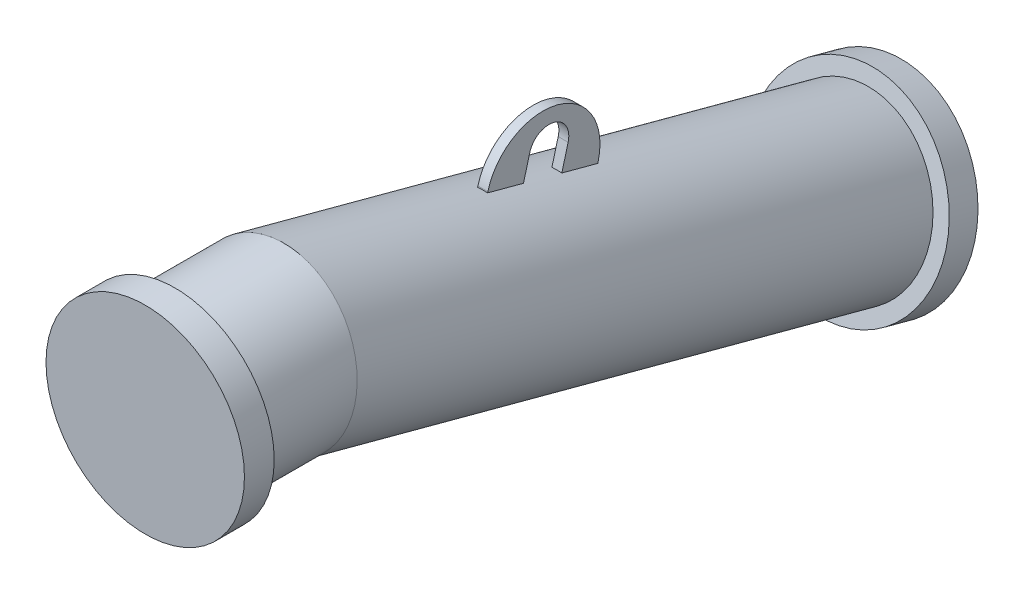
ISO-10303-21;
HEADER;
FILE_DESCRIPTION(('STEP AP214'),'2;1');
FILE_NAME('part.step','',(''),(''),'','','');
FILE_SCHEMA(('AUTOMOTIVE_DESIGN { 1 0 10303 214 1 1 1 1 }'));
ENDSEC;
DATA;
#1=APPLICATION_CONTEXT('core data for automotive mechanical design processes');
#2=APPLICATION_PROTOCOL_DEFINITION('international standard','automotive_design',2000,#1);
#3=PRODUCT_CONTEXT('',#1,'mechanical');
#4=PRODUCT('Part','Part','',(#3));
#5=PRODUCT_RELATED_PRODUCT_CATEGORY('part','',(#4));
#6=PRODUCT_DEFINITION_FORMATION('','',#4);
#7=PRODUCT_DEFINITION_CONTEXT('part definition',#1,'design');
#8=PRODUCT_DEFINITION('design','',#6,#7);
#9=PRODUCT_DEFINITION_SHAPE('','',#8);
#10=(LENGTH_UNIT() NAMED_UNIT(*) SI_UNIT(.MILLI.,.METRE.));
#11=(NAMED_UNIT(*) PLANE_ANGLE_UNIT() SI_UNIT($,.RADIAN.));
#12=(NAMED_UNIT(*) SI_UNIT($,.STERADIAN.) SOLID_ANGLE_UNIT());
#13=UNCERTAINTY_MEASURE_WITH_UNIT(LENGTH_MEASURE(1.E-05),#10,'distance_accuracy_value','');
#14=(GEOMETRIC_REPRESENTATION_CONTEXT(3) GLOBAL_UNCERTAINTY_ASSIGNED_CONTEXT((#13)) GLOBAL_UNIT_ASSIGNED_CONTEXT((#10,
#11,#12)) REPRESENTATION_CONTEXT('',''));
#15=CARTESIAN_POINT('',(0.,0.,0.));
#16=DIRECTION('',(0.,0.,1.));
#17=DIRECTION('',(1.,0.,0.));
#18=AXIS2_PLACEMENT_3D('',#15,#16,#17);
#19=CARTESIAN_POINT('',(0.,-162.729724187535,-736.054971760098));
#20=DIRECTION('',(0.,-0.258819045102521,-0.96592582628907));
#21=DIRECTION('',(1.,0.,0.));
#22=AXIS2_PLACEMENT_3D('',#19,#20,#21);
#23=PLANE('',#22);
#24=CARTESIAN_POINT('',(0.,-162.729724187535,-736.054971760098));
#25=DIRECTION('',(0.,-0.258819045102521,-0.96592582628907));
#26=DIRECTION('',(1.,0.,0.));
#27=AXIS2_PLACEMENT_3D('',#24,#25,#26);
#28=CIRCLE('',#27,100.);
#29=CARTESIAN_POINT('',(100.,-162.729724187535,-736.054971760098));
#30=VERTEX_POINT('',#29);
#31=EDGE_CURVE('E20',#30,#30,#28,.T.);
#32=ORIENTED_EDGE('',*,*,#31,.T.);
#33=EDGE_LOOP('',(#32));
#34=FACE_BOUND('',#33,.T.);
#35=ADVANCED_FACE('F16',(#34),#23,.T.);
#36=CARTESIAN_POINT('',(0.,-154.96515283446,-707.077196971427));
#37=DIRECTION('',(0.,-0.258819045102521,-0.96592582628907));
#38=DIRECTION('',(1.,0.,0.));
#39=AXIS2_PLACEMENT_3D('',#36,#37,#38);
#40=CYLINDRICAL_SURFACE('',#39,100.);
#41=CARTESIAN_POINT('',(0.,-154.96515283446,-707.077196971427));
#42=DIRECTION('',(0.,-0.258819045102521,-0.96592582628907));
#43=DIRECTION('',(1.,0.,0.));
#44=AXIS2_PLACEMENT_3D('',#41,#42,#43);
#45=CIRCLE('',#44,100.);
#46=CARTESIAN_POINT('',(100.,-154.96515283446,-707.077196971427));
#47=VERTEX_POINT('',#46);
#48=EDGE_CURVE('E27',#47,#47,#45,.T.);
#49=ORIENTED_EDGE('',*,*,#48,.T.);
#50=EDGE_LOOP('',(#49));
#51=FACE_BOUND('',#50,.T.);
#52=ORIENTED_EDGE('',*,*,#31,.F.);
#53=EDGE_LOOP('',(#52));
#54=FACE_BOUND('',#53,.T.);
#55=ADVANCED_FACE('F18',(#51,#54),#40,.T.);
#56=CARTESIAN_POINT('',(0.,-154.96515283446,-707.077196971427));
#57=DIRECTION('',(0.,-0.258819045102521,-0.96592582628907));
#58=DIRECTION('',(1.,0.,0.));
#59=AXIS2_PLACEMENT_3D('',#56,#57,#58);
#60=PLANE('',#59);
#61=CARTESIAN_POINT('',(0.,-154.965152834457,-707.077196971416));
#62=DIRECTION('',(0.,0.258819045102514,0.965925826289044));
#63=DIRECTION('',(1.,0.,0.));
#64=AXIS2_PLACEMENT_3D('',#61,#62,#63);
#65=CIRCLE('',#64,84.15);
#66=CARTESIAN_POINT('',(84.15,-154.965152834457,-707.077196971416));
#67=VERTEX_POINT('',#66);
#68=EDGE_CURVE('E10',#67,#67,#65,.T.);
#69=ORIENTED_EDGE('',*,*,#68,.F.);
#70=EDGE_LOOP('',(#69));
#71=FACE_BOUND('',#70,.T.);
#72=ORIENTED_EDGE('',*,*,#48,.F.);
#73=EDGE_LOOP('',(#72));
#74=FACE_BOUND('',#73,.T.);
#75=ADVANCED_FACE('F381',(#71,#74),#60,.F.);
#76=CARTESIAN_POINT('',(5.,39.1303698782753,-401.914653295312));
#77=DIRECTION('',(1.,0.,0.));
#78=DIRECTION('',(0.,0.965925826289068,-0.258819045102522));
#79=AXIS2_PLACEMENT_3D('',#76,#77,#78);
#80=PLANE('',#79);
#81=DIRECTION('',(0.,0.965925826289068,-0.258819045102523));
#82=VECTOR('',#81,1.);
#83=CARTESIAN_POINT('',(5.,21.6539497909867,-337.703480272756));
#84=LINE('',#83,#82);
#85=CARTESIAN_POINT('',(5.,30.3485614942685,-340.033194457152));
#86=VERTEX_POINT('',#85);
#87=CARTESIAN_POINT('',(5.,31.3132080538773,-340.291670723781));
#88=VERTEX_POINT('',#87);
#89=EDGE_CURVE('E315',#86,#88,#84,.T.);
#90=ORIENTED_EDGE('',*,*,#89,.F.);
#91=DIRECTION('',(0.,-0.258819045102514,-0.965925826289044));
#92=VECTOR('',#91,1.);
#93=CARTESIAN_POINT('',(5.00000000000001,-48.2704738762996,-633.44342890216));
#94=LINE('',#93,#92);
#95=CARTESIAN_POINT('',(5.00000000000001,20.6428473029207,-376.255412942997));
#96=VERTEX_POINT('',#95);
#97=EDGE_CURVE('E52',#86,#96,#94,.T.);
#98=ORIENTED_EDGE('',*,*,#97,.T.);
#99=DIRECTION('',(0.,0.965925826289069,-0.258819045102523));
#100=VECTOR('',#99,1.);
#101=CARTESIAN_POINT('',(5.00000000000001,21.6074938625331,-376.51388920962));
#102=LINE('',#101,#100);
#103=CARTESIAN_POINT('',(5.00000000000004,44.3067507803258,-382.596136769529));
#104=VERTEX_POINT('',#103);
#105=EDGE_CURVE('E322',#96,#104,#102,.T.);
#106=ORIENTED_EDGE('',*,*,#105,.T.);
#107=CARTESIAN_POINT('',(5.,39.1303698782753,-401.914653295312));
#108=DIRECTION('',(-1.,0.,0.));
#109=DIRECTION('',(0.,0.965925826289068,-0.258819045102522));
#110=AXIS2_PLACEMENT_3D('',#107,#108,#109);
#111=CIRCLE('',#110,20.);
#112=CARTESIAN_POINT('',(5.00000000000001,33.9539889762252,-421.233169821094));
#113=VERTEX_POINT('',#112);
#114=EDGE_CURVE('E325',#104,#113,#111,.T.);
#115=ORIENTED_EDGE('',*,*,#114,.T.);
#116=DIRECTION('',(0.,-0.965925826289068,0.258819045102522));
#117=VECTOR('',#116,1.);
#118=CARTESIAN_POINT('',(5.00000000000001,11.2547320584321,-415.150922261183));
#119=LINE('',#118,#117);
#120=CARTESIAN_POINT('',(5.00000000000001,10.2900854988201,-414.892445994559));
#121=VERTEX_POINT('',#120);
#122=EDGE_CURVE('E329',#113,#121,#119,.T.);
#123=ORIENTED_EDGE('',*,*,#122,.T.);
#124=CARTESIAN_POINT('',(5.00000000000001,0.584371307478751,-451.114664480395));
#125=VERTEX_POINT('',#124);
#126=EDGE_CURVE('E294',#121,#125,#94,.T.);
#127=ORIENTED_EDGE('',*,*,#126,.T.);
#128=DIRECTION('',(0.,0.965925826289068,-0.258819045102523));
#129=VECTOR('',#128,1.);
#130=CARTESIAN_POINT('',(5.00000000000001,-8.11024039580332,-448.784950295998));
#131=LINE('',#130,#129);
#132=CARTESIAN_POINT('',(5.00000000000001,1.54901786708727,-451.373140747023));
#133=VERTEX_POINT('',#132);
#134=EDGE_CURVE('E309',#125,#133,#131,.T.);
#135=ORIENTED_EDGE('',*,*,#134,.T.);
#136=CARTESIAN_POINT('',(5.00000000000002,16.4311129604825,-395.832405735402));
#137=DIRECTION('',(1.,0.,0.));
#138=DIRECTION('',(0.,0.965925826289068,-0.258819045102522));
#139=AXIS2_PLACEMENT_3D('',#136,#137,#138);
#140=CIRCLE('',#139,57.5);
#141=EDGE_CURVE('E332',#133,#88,#140,.T.);
#142=ORIENTED_EDGE('',*,*,#141,.T.);
#143=EDGE_LOOP('',(#90,#98,#106,#115,#123,#127,#135,#142));
#144=FACE_BOUND('',#143,.T.);
#145=ADVANCED_FACE('F387',(#144),#80,.T.);
#146=CARTESIAN_POINT('',(-5.00000000000002,39.1303698782756,-401.914653295311));
#147=DIRECTION('',(1.,0.,0.));
#148=DIRECTION('',(0.,0.965925826289068,-0.258819045102522));
#149=AXIS2_PLACEMENT_3D('',#146,#147,#148);
#150=PLANE('',#149);
#151=DIRECTION('',(0.,-0.258819045102514,-0.965925826289044));
#152=VECTOR('',#151,1.);
#153=CARTESIAN_POINT('',(-5.00000000000006,-48.2704738762996,-633.44342890216));
#154=LINE('',#153,#152);
#155=CARTESIAN_POINT('',(-5.00000000000002,30.3485614942687,-340.033194457152));
#156=VERTEX_POINT('',#155);
#157=CARTESIAN_POINT('',(-5.00000000000004,20.6428473029207,-376.255412942997));
#158=VERTEX_POINT('',#157);
#159=EDGE_CURVE('E295',#156,#158,#154,.T.);
#160=ORIENTED_EDGE('',*,*,#159,.F.);
#161=DIRECTION('',(0.,0.965925826289068,-0.258819045102523));
#162=VECTOR('',#161,1.);
#163=CARTESIAN_POINT('',(-5.00000000000002,21.6539497909869,-337.703480272755));
#164=LINE('',#163,#162);
#165=CARTESIAN_POINT('',(-5.00000000000002,31.3132080538773,-340.29167072378));
#166=VERTEX_POINT('',#165);
#167=EDGE_CURVE('E318',#156,#166,#164,.T.);
#168=ORIENTED_EDGE('',*,*,#167,.T.);
#169=CARTESIAN_POINT('',(-5.00000000000001,16.4311129604826,-395.832405735402));
#170=DIRECTION('',(1.,0.,0.));
#171=DIRECTION('',(0.,0.965925826289068,-0.258819045102522));
#172=AXIS2_PLACEMENT_3D('',#169,#170,#171);
#173=CIRCLE('',#172,57.5);
#174=CARTESIAN_POINT('',(-5.00000000000001,1.54901786708719,-451.373140747024));
#175=VERTEX_POINT('',#174);
#176=EDGE_CURVE('E326',#175,#166,#173,.T.);
#177=ORIENTED_EDGE('',*,*,#176,.F.);
#178=DIRECTION('',(0.,0.965925826289068,-0.258819045102523));
#179=VECTOR('',#178,1.);
#180=CARTESIAN_POINT('',(-5.00000000000001,-8.11024039580349,-448.784950295999));
#181=LINE('',#180,#179);
#182=CARTESIAN_POINT('',(-5.00000000000001,0.584371307478584,-451.114664480396));
#183=VERTEX_POINT('',#182);
#184=EDGE_CURVE('E312',#183,#175,#181,.T.);
#185=ORIENTED_EDGE('',*,*,#184,.F.);
#186=CARTESIAN_POINT('',(-5.00000000000004,10.29008549882,-414.892445994559));
#187=VERTEX_POINT('',#186);
#188=EDGE_CURVE('E279',#187,#183,#154,.T.);
#189=ORIENTED_EDGE('',*,*,#188,.F.);
#190=DIRECTION('',(0.,-0.965925826289068,0.258819045102522));
#191=VECTOR('',#190,1.);
#192=CARTESIAN_POINT('',(-5.00000000000001,11.2547320584321,-415.150922261183));
#193=LINE('',#192,#191);
#194=CARTESIAN_POINT('',(-5.00000000000002,33.9539889762252,-421.233169821094));
#195=VERTEX_POINT('',#194);
#196=EDGE_CURVE('E342',#195,#187,#193,.T.);
#197=ORIENTED_EDGE('',*,*,#196,.F.);
#198=CARTESIAN_POINT('',(-5.00000000000002,39.1303698782756,-401.914653295311));
#199=DIRECTION('',(-1.,0.,0.));
#200=DIRECTION('',(0.,0.965925826289068,-0.258819045102522));
#201=AXIS2_PLACEMENT_3D('',#198,#199,#200);
#202=CIRCLE('',#201,20.);
#203=CARTESIAN_POINT('',(-4.99999999999999,44.3067507803258,-382.596136769529));
#204=VERTEX_POINT('',#203);
#205=EDGE_CURVE('E339',#204,#195,#202,.T.);
#206=ORIENTED_EDGE('',*,*,#205,.F.);
#207=DIRECTION('',(0.,0.965925826289069,-0.258819045102523));
#208=VECTOR('',#207,1.);
#209=CARTESIAN_POINT('',(-5.00000000000001,21.6074938625331,-376.51388920962));
#210=LINE('',#209,#208);
#211=EDGE_CURVE('E321',#158,#204,#210,.T.);
#212=ORIENTED_EDGE('',*,*,#211,.F.);
#213=EDGE_LOOP('',(#160,#168,#177,#185,#189,#197,#206,#212));
#214=FACE_BOUND('',#213,.T.);
#215=ADVANCED_FACE('F397',(#214),#150,.F.);
#216=CARTESIAN_POINT('',(5.00000000000001,21.6074938625331,-376.51388920962));
#217=DIRECTION('',(0.,0.258819045102521,0.965925826289069));
#218=DIRECTION('',(0.,-0.965925826289069,0.258819045102523));
#219=AXIS2_PLACEMENT_3D('',#216,#217,#218);
#220=PLANE('',#219);
#221=CARTESIAN_POINT('',(0.,-60.4962013720365,-354.514270375906));
#222=DIRECTION('',(0.,0.258819045102521,0.965925826289069));
#223=DIRECTION('',(0.,-0.965925826289068,0.258819045102521));
#224=AXIS2_PLACEMENT_3D('',#221,#222,#223);
#225=CIRCLE('',#224,84.15);
#226=EDGE_CURVE('E305',#158,#96,#225,.F.);
#227=ORIENTED_EDGE('',*,*,#226,.F.);
#228=ORIENTED_EDGE('',*,*,#211,.T.);
#229=DIRECTION('',(-1.,0.,0.));
#230=VECTOR('',#229,1.);
#231=CARTESIAN_POINT('',(5.00000000000004,44.3067507803258,-382.596136769529));
#232=LINE('',#231,#230);
#233=EDGE_CURVE('E359',#104,#204,#232,.T.);
#234=ORIENTED_EDGE('',*,*,#233,.F.);
#235=ORIENTED_EDGE('',*,*,#105,.F.);
#236=EDGE_LOOP('',(#227,#228,#234,#235));
#237=FACE_BOUND('',#236,.T.);
#238=ADVANCED_FACE('F393',(#237),#220,.F.);
#239=CARTESIAN_POINT('',(5.,39.1303698782753,-401.914653295312));
#240=DIRECTION('',(-1.,0.,0.));
#241=DIRECTION('',(0.,-0.965925826289068,0.258819045102522));
#242=AXIS2_PLACEMENT_3D('',#239,#240,#241);
#243=CYLINDRICAL_SURFACE('',#242,20.);
#244=ORIENTED_EDGE('',*,*,#205,.T.);
#245=DIRECTION('',(-1.,0.,0.));
#246=VECTOR('',#245,1.);
#247=CARTESIAN_POINT('',(5.00000000000001,33.9539889762252,-421.233169821094));
#248=LINE('',#247,#246);
#249=EDGE_CURVE('E355',#113,#195,#248,.T.);
#250=ORIENTED_EDGE('',*,*,#249,.F.);
#251=ORIENTED_EDGE('',*,*,#114,.F.);
#252=ORIENTED_EDGE('',*,*,#233,.T.);
#253=EDGE_LOOP('',(#244,#250,#251,#252));
#254=FACE_BOUND('',#253,.T.);
#255=ADVANCED_FACE('F396',(#254),#243,.F.);
#256=CARTESIAN_POINT('',(5.00000000000001,11.2547320584321,-415.150922261183));
#257=DIRECTION('',(0.,-0.258819045102521,-0.96592582628907));
#258=DIRECTION('',(0.,0.965925826289068,-0.258819045102522));
#259=AXIS2_PLACEMENT_3D('',#256,#257,#258);
#260=PLANE('',#259);
#261=CARTESIAN_POINT('',(0.,-70.8489631761375,-393.151303427469));
#262=DIRECTION('',(0.,-0.258819045102521,-0.96592582628907));
#263=DIRECTION('',(0.,0.965925826289069,-0.25881904510252));
#264=AXIS2_PLACEMENT_3D('',#261,#262,#263);
#265=CIRCLE('',#264,84.15);
#266=EDGE_CURVE('E40',#121,#187,#265,.F.);
#267=ORIENTED_EDGE('',*,*,#266,.F.);
#268=ORIENTED_EDGE('',*,*,#122,.F.);
#269=ORIENTED_EDGE('',*,*,#249,.T.);
#270=ORIENTED_EDGE('',*,*,#196,.T.);
#271=EDGE_LOOP('',(#267,#268,#269,#270));
#272=FACE_BOUND('',#271,.T.);
#273=ADVANCED_FACE('F401',(#272),#260,.F.);
#274=CARTESIAN_POINT('',(5.00000000000002,16.4311129604825,-395.832405735402));
#275=DIRECTION('',(-1.,0.,0.));
#276=DIRECTION('',(0.,-0.965925826289068,0.258819045102522));
#277=AXIS2_PLACEMENT_3D('',#274,#275,#276);
#278=CYLINDRICAL_SURFACE('',#277,57.5);
#279=ORIENTED_EDGE('',*,*,#176,.T.);
#280=DIRECTION('',(-1.,0.,0.));
#281=VECTOR('',#280,1.);
#282=CARTESIAN_POINT('',(5.,31.3132080538773,-340.291670723781));
#283=LINE('',#282,#281);
#284=EDGE_CURVE('E336',#88,#166,#283,.T.);
#285=ORIENTED_EDGE('',*,*,#284,.F.);
#286=ORIENTED_EDGE('',*,*,#141,.F.);
#287=DIRECTION('',(-1.,0.,0.));
#288=VECTOR('',#287,1.);
#289=CARTESIAN_POINT('',(5.00000000000001,1.54901786708727,-451.373140747023));
#290=LINE('',#289,#288);
#291=EDGE_CURVE('E351',#133,#175,#290,.T.);
#292=ORIENTED_EDGE('',*,*,#291,.T.);
#293=EDGE_LOOP('',(#279,#285,#286,#292));
#294=FACE_BOUND('',#293,.T.);
#295=ADVANCED_FACE('F405',(#294),#278,.T.);
#296=CARTESIAN_POINT('',(5.,21.6539497909867,-337.703480272756));
#297=DIRECTION('',(0.,-0.258819045102523,-0.965925826289068));
#298=DIRECTION('',(0.,0.965925826289068,-0.258819045102523));
#299=AXIS2_PLACEMENT_3D('',#296,#297,#298);
#300=PLANE('',#299);
#301=CARTESIAN_POINT('',(0.,-50.7904871806922,-318.292051890067));
#302=DIRECTION('',(0.,-0.258819045102523,-0.965925826289068));
#303=DIRECTION('',(0.,0.965925826289068,-0.258819045102523));
#304=AXIS2_PLACEMENT_3D('',#301,#302,#303);
#305=CIRCLE('',#304,84.15);
#306=EDGE_CURVE('E301',#86,#156,#305,.F.);
#307=ORIENTED_EDGE('',*,*,#306,.F.);
#308=ORIENTED_EDGE('',*,*,#89,.T.);
#309=ORIENTED_EDGE('',*,*,#284,.T.);
#310=ORIENTED_EDGE('',*,*,#167,.F.);
#311=EDGE_LOOP('',(#307,#308,#309,#310));
#312=FACE_BOUND('',#311,.T.);
#313=ADVANCED_FACE('F408',(#312),#300,.F.);
#314=CARTESIAN_POINT('',(-5.00000000000001,-8.11024039580349,-448.784950295999));
#315=DIRECTION('',(0.,0.258819045102523,0.965925826289068));
#316=DIRECTION('',(0.,-0.965925826289068,0.258819045102523));
#317=AXIS2_PLACEMENT_3D('',#314,#315,#316);
#318=PLANE('',#317);
#319=CARTESIAN_POINT('',(0.,-80.5546773674822,-429.37352191331));
#320=DIRECTION('',(0.,0.258819045102523,0.965925826289068));
#321=DIRECTION('',(0.,-0.965925826289068,0.258819045102523));
#322=AXIS2_PLACEMENT_3D('',#319,#320,#321);
#323=CIRCLE('',#322,84.15);
#324=EDGE_CURVE('E363',#183,#125,#323,.F.);
#325=ORIENTED_EDGE('',*,*,#324,.F.);
#326=ORIENTED_EDGE('',*,*,#184,.T.);
#327=ORIENTED_EDGE('',*,*,#291,.F.);
#328=ORIENTED_EDGE('',*,*,#134,.F.);
#329=EDGE_LOOP('',(#325,#326,#327,#328));
#330=FACE_BOUND('',#329,.T.);
#331=ADVANCED_FACE('F417',(#330),#318,.F.);
#332=CARTESIAN_POINT('',(0.,-129.409522551259,-611.702286335075));
#333=DIRECTION('',(0.,-0.258819045102514,-0.965925826289044));
#334=DIRECTION('',(-1.,0.,0.));
#335=AXIS2_PLACEMENT_3D('',#332,#333,#334);
#336=CYLINDRICAL_SURFACE('',#335,84.15);
#337=ORIENTED_EDGE('',*,*,#68,.T.);
#338=EDGE_LOOP('',(#337));
#339=FACE_BOUND('',#338,.T.);
#340=CARTESIAN_POINT('',(0.,0.,-128.739373190547));
#341=DIRECTION('',(0.,-0.130526192220052,-0.991444861373812));
#342=DIRECTION('',(0.,-0.991444861373812,0.130526192220052));
#343=AXIS2_PLACEMENT_3D('',#340,#341,#342);
#344=ELLIPSE('',#343,84.8761270328199,84.15);
#345=CARTESIAN_POINT('',(0.,-84.1500000000001,-117.660815518567));
#346=VERTEX_POINT('',#345);
#347=EDGE_CURVE('E271',#346,#346,#344,.T.);
#348=ORIENTED_EDGE('',*,*,#347,.T.);
#349=EDGE_LOOP('',(#348));
#350=FACE_BOUND('',#349,.T.);
#351=ORIENTED_EDGE('',*,*,#126,.F.);
#352=ORIENTED_EDGE('',*,*,#266,.T.);
#353=ORIENTED_EDGE('',*,*,#188,.T.);
#354=ORIENTED_EDGE('',*,*,#324,.T.);
#355=EDGE_LOOP('',(#351,#352,#353,#354));
#356=FACE_BOUND('',#355,.T.);
#357=ORIENTED_EDGE('',*,*,#159,.T.);
#358=ORIENTED_EDGE('',*,*,#226,.T.);
#359=ORIENTED_EDGE('',*,*,#97,.F.);
#360=ORIENTED_EDGE('',*,*,#306,.T.);
#361=EDGE_LOOP('',(#357,#358,#359,#360));
#362=FACE_BOUND('',#361,.T.);
#363=ADVANCED_FACE('F421',(#339,#350,#356,#362),#336,.T.);
#364=CARTESIAN_POINT('',(0.,-3.60822483003176E-13,-29.9999999999989));
#365=DIRECTION('',(0.,0.,1.));
#366=DIRECTION('',(1.,0.,0.));
#367=AXIS2_PLACEMENT_3D('',#364,#365,#366);
#368=CYLINDRICAL_SURFACE('',#367,100.);
#369=CARTESIAN_POINT('',(0.,-3.60822483003176E-13,-29.9999999999989));
#370=DIRECTION('',(0.,0.,1.));
#371=DIRECTION('',(1.,0.,0.));
#372=AXIS2_PLACEMENT_3D('',#369,#370,#371);
#373=CIRCLE('',#372,100.);
#374=CARTESIAN_POINT('',(100.,-3.86571475861723E-13,-29.9999999999989));
#375=VERTEX_POINT('',#374);
#376=EDGE_CURVE('E280',#375,#375,#373,.T.);
#377=ORIENTED_EDGE('',*,*,#376,.T.);
#378=EDGE_LOOP('',(#377));
#379=FACE_BOUND('',#378,.T.);
#380=CARTESIAN_POINT('',(0.,0.,0.));
#381=DIRECTION('',(0.,0.,1.));
#382=DIRECTION('',(1.,0.,0.));
#383=AXIS2_PLACEMENT_3D('',#380,#381,#382);
#384=CIRCLE('',#383,100.);
#385=CARTESIAN_POINT('',(100.,0.,0.));
#386=VERTEX_POINT('',#385);
#387=EDGE_CURVE('E284',#386,#386,#384,.T.);
#388=ORIENTED_EDGE('',*,*,#387,.F.);
#389=EDGE_LOOP('',(#388));
#390=FACE_BOUND('',#389,.T.);
#391=ADVANCED_FACE('F423',(#379,#390),#368,.T.);
#392=CARTESIAN_POINT('',(0.,-3.60822483003176E-13,-29.9999999999989));
#393=DIRECTION('',(0.,0.,1.));
#394=DIRECTION('',(1.,0.,0.));
#395=AXIS2_PLACEMENT_3D('',#392,#393,#394);
#396=PLANE('',#395);
#397=CARTESIAN_POINT('',(0.,0.,-30.));
#398=DIRECTION('',(0.,0.,-1.));
#399=DIRECTION('',(-1.,0.,0.));
#400=AXIS2_PLACEMENT_3D('',#397,#398,#399);
#401=CIRCLE('',#400,84.15);
#402=CARTESIAN_POINT('',(-84.1500000000002,0.,-30.));
#403=VERTEX_POINT('',#402);
#404=EDGE_CURVE('E275',#403,#403,#401,.T.);
#405=ORIENTED_EDGE('',*,*,#404,.F.);
#406=EDGE_LOOP('',(#405));
#407=FACE_BOUND('',#406,.T.);
#408=ORIENTED_EDGE('',*,*,#376,.F.);
#409=EDGE_LOOP('',(#408));
#410=FACE_BOUND('',#409,.T.);
#411=ADVANCED_FACE('F426',(#407,#410),#396,.F.);
#412=CARTESIAN_POINT('',(0.,0.,-128.739373190547));
#413=DIRECTION('',(0.,0.,1.));
#414=DIRECTION('',(1.,0.,0.));
#415=AXIS2_PLACEMENT_3D('',#412,#413,#414);
#416=CYLINDRICAL_SURFACE('',#415,84.15);
#417=ORIENTED_EDGE('',*,*,#404,.T.);
#418=EDGE_LOOP('',(#417));
#419=FACE_BOUND('',#418,.T.);
#420=ORIENTED_EDGE('',*,*,#347,.F.);
#421=EDGE_LOOP('',(#420));
#422=FACE_BOUND('',#421,.T.);
#423=ADVANCED_FACE('F431',(#419,#422),#416,.T.);
#424=CARTESIAN_POINT('',(0.,0.,0.));
#425=DIRECTION('',(0.,0.,1.));
#426=DIRECTION('',(1.,0.,0.));
#427=AXIS2_PLACEMENT_3D('',#424,#425,#426);
#428=PLANE('',#427);
#429=ORIENTED_EDGE('',*,*,#387,.T.);
#430=EDGE_LOOP('',(#429));
#431=FACE_BOUND('',#430,.T.);
#432=ADVANCED_FACE('F428',(#431),#428,.T.);
#433=CLOSED_SHELL('',(#35,#55,#75,#145,#215,#238,#255,#273,#295,#313,#331,#363,#391,#411,#423,#432));
#434=CARTESIAN_POINT('',(0.,-3.60822483003176E-13,-29.9999999999989));
#435=DIRECTION('',(0.,0.,1.));
#436=DIRECTION('',(1.,0.,0.));
#437=AXIS2_PLACEMENT_3D('',#434,#435,#436);
#438=PLANE('',#437);
#439=CARTESIAN_POINT('',(0.,-3.60822483003176E-13,-29.9999999999989));
#440=DIRECTION('',(0.,0.,1.));
#441=DIRECTION('',(1.,0.,0.));
#442=AXIS2_PLACEMENT_3D('',#439,#440,#441);
#443=CIRCLE('',#442,39.5);
#444=CARTESIAN_POINT('',(39.5,-3.70993335182302E-13,-29.9999999999989));
#445=VERTEX_POINT('',#444);
#446=EDGE_CURVE('E208',#445,#445,#443,.T.);
#447=ORIENTED_EDGE('',*,*,#446,.T.);
#448=EDGE_LOOP('',(#447));
#449=FACE_BOUND('',#448,.T.);
#450=CARTESIAN_POINT('',(0.,0.,-30.));
#451=DIRECTION('',(0.,0.,-1.));
#452=DIRECTION('',(0.,1.,0.));
#453=AXIS2_PLACEMENT_3D('',#450,#451,#452);
#454=CIRCLE('',#453,40.);
#455=CARTESIAN_POINT('',(0.,40.,-30.));
#456=VERTEX_POINT('',#455);
#457=EDGE_CURVE('E266',#456,#456,#454,.T.);
#458=ORIENTED_EDGE('',*,*,#457,.T.);
#459=EDGE_LOOP('',(#458));
#460=FACE_BOUND('',#459,.T.);
#461=ADVANCED_FACE('F446',(#449,#460),#438,.F.);
#462=CARTESIAN_POINT('',(0.,-750.,-30.));
#463=DIRECTION('',(-1.,0.,0.));
#464=DIRECTION('',(0.,0.,1.));
#465=AXIS2_PLACEMENT_3D('',#462,#463,#464);
#466=TOROIDAL_SURFACE('',#465,750.,40.);
#467=CARTESIAN_POINT('',(0.,-25.5556302831988,-224.114283826891));
#468=DIRECTION('',(0.,0.258819045102523,0.96592582628907));
#469=DIRECTION('',(1.,0.,0.));
#470=AXIS2_PLACEMENT_3D('',#467,#468,#469);
#471=CIRCLE('',#470,40.);
#472=CARTESIAN_POINT('',(0.,13.081402768364,-234.467045630991));
#473=VERTEX_POINT('',#472);
#474=EDGE_CURVE('E262',#473,#473,#471,.T.);
#475=CARTESIAN_POINT('',(0.,-750.,-30.));
#476=DIRECTION('',(-1.,0.,0.));
#477=DIRECTION('',(0.,0.,1.));
#478=AXIS2_PLACEMENT_3D('',#475,#476,#477);
#479=CIRCLE('',#478,790.);
#480=EDGE_CURVE('',#456,#473,#479,.T.);
#481=ORIENTED_EDGE('',*,*,#457,.F.);
#482=ORIENTED_EDGE('',*,*,#474,.F.);
#483=ORIENTED_EDGE('',*,*,#480,.T.);
#484=ORIENTED_EDGE('',*,*,#480,.F.);
#485=EDGE_LOOP('',(#481,#483,#482,#484));
#486=FACE_BOUND('',#485,.T.);
#487=ADVANCED_FACE('F442',(#486),#466,.F.);
#488=CARTESIAN_POINT('',(0.,-25.5556302831988,-224.114283826891));
#489=DIRECTION('',(0.,-0.258819045102523,-0.96592582628907));
#490=DIRECTION('',(-1.,0.,0.));
#491=AXIS2_PLACEMENT_3D('',#488,#489,#490);
#492=CYLINDRICAL_SURFACE('',#491,40.);
#493=ORIENTED_EDGE('',*,*,#474,.T.);
#494=EDGE_LOOP('',(#493));
#495=FACE_BOUND('',#494,.T.);
#496=CARTESIAN_POINT('',(0.,-154.96515283446,-707.077196971426));
#497=DIRECTION('',(0.,0.258819045102523,0.96592582628907));
#498=DIRECTION('',(1.,0.,0.));
#499=AXIS2_PLACEMENT_3D('',#496,#497,#498);
#500=CIRCLE('',#499,40.);
#501=CARTESIAN_POINT('',(40.,-154.96515283446,-707.077196971426));
#502=VERTEX_POINT('',#501);
#503=EDGE_CURVE('E267',#502,#502,#500,.T.);
#504=ORIENTED_EDGE('',*,*,#503,.F.);
#505=EDGE_LOOP('',(#504));
#506=FACE_BOUND('',#505,.T.);
#507=ADVANCED_FACE('F445',(#495,#506),#492,.F.);
#508=CARTESIAN_POINT('',(0.,-154.96515283446,-707.077196971427));
#509=DIRECTION('',(0.,-0.258819045102521,-0.96592582628907));
#510=DIRECTION('',(1.,0.,0.));
#511=AXIS2_PLACEMENT_3D('',#508,#509,#510);
#512=PLANE('',#511);
#513=CARTESIAN_POINT('',(0.,-154.96515283446,-707.077196971427));
#514=DIRECTION('',(0.,-0.258819045102521,-0.96592582628907));
#515=DIRECTION('',(1.,0.,0.));
#516=AXIS2_PLACEMENT_3D('',#513,#514,#515);
#517=CIRCLE('',#516,39.5);
#518=CARTESIAN_POINT('',(39.5,-154.96515283446,-707.077196971427));
#519=VERTEX_POINT('',#518);
#520=EDGE_CURVE('E648',#519,#519,#517,.T.);
#521=ORIENTED_EDGE('',*,*,#520,.T.);
#522=EDGE_LOOP('',(#521));
#523=FACE_BOUND('',#522,.T.);
#524=ORIENTED_EDGE('',*,*,#503,.T.);
#525=EDGE_LOOP('',(#524));
#526=FACE_BOUND('',#525,.T.);
#527=ADVANCED_FACE('F451',(#523,#526),#512,.F.);
#528=CARTESIAN_POINT('',(0.,-154.96515283446,-707.077196971427));
#529=DIRECTION('',(0.,-0.258819045102521,-0.96592582628907));
#530=DIRECTION('',(1.,0.,0.));
#531=AXIS2_PLACEMENT_3D('',#528,#529,#530);
#532=CYLINDRICAL_SURFACE('',#531,39.5);
#533=ORIENTED_EDGE('',*,*,#520,.F.);
#534=EDGE_LOOP('',(#533));
#535=FACE_BOUND('',#534,.T.);
#536=CARTESIAN_POINT('',(0.,-156.259248059972,-711.906826102872));
#537=DIRECTION('',(0.,-0.258819045102521,-0.965925826289068));
#538=DIRECTION('',(0.,0.965925826289068,-0.258819045102521));
#539=AXIS2_PLACEMENT_3D('',#536,#537,#538);
#540=CIRCLE('',#539,39.5);
#541=CARTESIAN_POINT('',(0.,-118.105177921554,-722.130178384421));
#542=VERTEX_POINT('',#541);
#543=EDGE_CURVE('E201',#542,#542,#540,.F.);
#544=ORIENTED_EDGE('',*,*,#543,.F.);
#545=EDGE_LOOP('',(#544));
#546=FACE_BOUND('',#545,.T.);
#547=ADVANCED_FACE('F455',(#535,#546),#532,.F.);
#548=CARTESIAN_POINT('',(0.,-156.259248059972,-711.906826102872));
#549=DIRECTION('',(0.,-0.258819045102521,-0.965925826289068));
#550=DIRECTION('',(0.,0.965925826289068,-0.258819045102521));
#551=AXIS2_PLACEMENT_3D('',#548,#549,#550);
#552=PLANE('',#551);
#553=ORIENTED_EDGE('',*,*,#543,.T.);
#554=EDGE_LOOP('',(#553));
#555=FACE_BOUND('',#554,.T.);
#556=ADVANCED_FACE('F594',(#555),#552,.F.);
#557=CARTESIAN_POINT('',(0.,0.,-25.));
#558=DIRECTION('',(0.,0.,1.));
#559=DIRECTION('',(1.,0.,0.));
#560=AXIS2_PLACEMENT_3D('',#557,#558,#559);
#561=PLANE('',#560);
#562=CARTESIAN_POINT('',(0.,-3.60822483003176E-13,-25.));
#563=DIRECTION('',(0.,0.,1.));
#564=DIRECTION('',(1.,0.,0.));
#565=AXIS2_PLACEMENT_3D('',#562,#563,#564);
#566=CIRCLE('',#565,39.5);
#567=CARTESIAN_POINT('',(39.5,-3.60822483003176E-13,-25.));
#568=VERTEX_POINT('',#567);
#569=EDGE_CURVE('E207',#568,#568,#566,.F.);
#570=ORIENTED_EDGE('',*,*,#569,.T.);
#571=EDGE_LOOP('',(#570));
#572=FACE_BOUND('',#571,.T.);
#573=ADVANCED_FACE('F590',(#572),#561,.F.);
#574=CARTESIAN_POINT('',(0.,-3.60822483003176E-13,-29.9999999999989));
#575=DIRECTION('',(0.,0.,1.));
#576=DIRECTION('',(1.,0.,0.));
#577=AXIS2_PLACEMENT_3D('',#574,#575,#576);
#578=CYLINDRICAL_SURFACE('',#577,39.5);
#579=ORIENTED_EDGE('',*,*,#446,.F.);
#580=EDGE_LOOP('',(#579));
#581=FACE_BOUND('',#580,.T.);
#582=ORIENTED_EDGE('',*,*,#569,.F.);
#583=EDGE_LOOP('',(#582));
#584=FACE_BOUND('',#583,.T.);
#585=ADVANCED_FACE('F593',(#581,#584),#578,.F.);
#586=CLOSED_SHELL('',(#461,#487,#507,#527,#547,#556,#573,#585));
#587=CARTESIAN_POINT('',(-30.614674589207,-73.9103626009032,-23.9999999999986));
#588=DIRECTION('',(0.,0.,1.));
#589=DIRECTION('',(0.,-1.,0.));
#590=AXIS2_PLACEMENT_3D('',#587,#588,#589);
#591=PLANE('',#590);
#592=CARTESIAN_POINT('',(-30.614674589207,-73.9103626009032,-23.9999999999986));
#593=DIRECTION('',(0.,0.,1.));
#594=DIRECTION('',(1.,0.,0.));
#595=AXIS2_PLACEMENT_3D('',#592,#593,#594);
#596=CIRCLE('',#595,6.99999999999999);
#597=CARTESIAN_POINT('',(-23.614674589207,-73.9103626009032,-23.9999999999986));
#598=VERTEX_POINT('',#597);
#599=EDGE_CURVE('E215',#598,#598,#596,.T.);
#600=ORIENTED_EDGE('',*,*,#599,.F.);
#601=EDGE_LOOP('',(#600));
#602=FACE_BOUND('',#601,.T.);
#603=ADVANCED_FACE('F580',(#602),#591,.F.);
#604=CARTESIAN_POINT('',(-30.614674589207,-73.9103626009032,-23.9999999999986));
#605=DIRECTION('',(0.,0.,1.));
#606=DIRECTION('',(1.,0.,0.));
#607=AXIS2_PLACEMENT_3D('',#604,#605,#606);
#608=CONICAL_SURFACE('',#607,6.99999999999999,1.02974425867665);
#609=CARTESIAN_POINT('',(-30.614674589207,-73.9103626009034,-28.2060243331915));
#610=VERTEX_POINT('',#609);
#611=VERTEX_LOOP('',#610);
#612=FACE_BOUND('',#611,.T.);
#613=ORIENTED_EDGE('',*,*,#599,.T.);
#614=EDGE_LOOP('',(#613));
#615=FACE_BOUND('',#614,.T.);
#616=ADVANCED_FACE('F583',(#612,#615),#608,.F.);
#617=CLOSED_SHELL('',(#603,#616));
#618=CARTESIAN_POINT('',(30.6146745892075,-73.9103626009032,-23.9999999999986));
#619=DIRECTION('',(0.,0.,1.));
#620=DIRECTION('',(0.,-1.,0.));
#621=AXIS2_PLACEMENT_3D('',#618,#619,#620);
#622=PLANE('',#621);
#623=CARTESIAN_POINT('',(30.6146745892075,-73.9103626009032,-23.9999999999986));
#624=DIRECTION('',(0.,0.,1.));
#625=DIRECTION('',(1.,0.,0.));
#626=AXIS2_PLACEMENT_3D('',#623,#624,#625);
#627=CIRCLE('',#626,6.99999999999999);
#628=CARTESIAN_POINT('',(37.6146745892075,-73.9103626009032,-23.9999999999986));
#629=VERTEX_POINT('',#628);
#630=EDGE_CURVE('E220',#629,#629,#627,.T.);
#631=ORIENTED_EDGE('',*,*,#630,.F.);
#632=EDGE_LOOP('',(#631));
#633=FACE_BOUND('',#632,.T.);
#634=ADVANCED_FACE('F570',(#633),#622,.F.);
#635=CARTESIAN_POINT('',(30.6146745892075,-73.9103626009032,-23.9999999999986));
#636=DIRECTION('',(0.,0.,1.));
#637=DIRECTION('',(1.,0.,0.));
#638=AXIS2_PLACEMENT_3D('',#635,#636,#637);
#639=CONICAL_SURFACE('',#638,6.99999999999999,1.02974425867665);
#640=CARTESIAN_POINT('',(30.6146745892075,-73.9103626009029,-28.206024333193));
#641=VERTEX_POINT('',#640);
#642=VERTEX_LOOP('',#641);
#643=FACE_BOUND('',#642,.T.);
#644=ORIENTED_EDGE('',*,*,#630,.T.);
#645=EDGE_LOOP('',(#644));
#646=FACE_BOUND('',#645,.T.);
#647=ADVANCED_FACE('F573',(#643,#646),#639,.F.);
#648=CLOSED_SHELL('',(#634,#647));
#649=CARTESIAN_POINT('',(73.910362600903,-30.6146745892071,-23.9999999999987));
#650=DIRECTION('',(0.,0.,1.));
#651=DIRECTION('',(0.,-1.,0.));
#652=AXIS2_PLACEMENT_3D('',#649,#650,#651);
#653=PLANE('',#652);
#654=CARTESIAN_POINT('',(73.910362600903,-30.6146745892071,-23.9999999999987));
#655=DIRECTION('',(0.,0.,1.));
#656=DIRECTION('',(1.,0.,0.));
#657=AXIS2_PLACEMENT_3D('',#654,#655,#656);
#658=CIRCLE('',#657,7.);
#659=CARTESIAN_POINT('',(80.910362600903,-30.6146745892071,-23.9999999999987));
#660=VERTEX_POINT('',#659);
#661=EDGE_CURVE('E194',#660,#660,#658,.T.);
#662=ORIENTED_EDGE('',*,*,#661,.F.);
#663=EDGE_LOOP('',(#662));
#664=FACE_BOUND('',#663,.T.);
#665=ADVANCED_FACE('F560',(#664),#653,.F.);
#666=CARTESIAN_POINT('',(73.910362600903,-30.6146745892071,-23.9999999999987));
#667=DIRECTION('',(0.,0.,1.));
#668=DIRECTION('',(1.,0.,0.));
#669=AXIS2_PLACEMENT_3D('',#666,#667,#668);
#670=CONICAL_SURFACE('',#669,7.,1.02974425867665);
#671=CARTESIAN_POINT('',(73.910362600903,-30.6146745892072,-28.2060243331919));
#672=VERTEX_POINT('',#671);
#673=VERTEX_LOOP('',#672);
#674=FACE_BOUND('',#673,.T.);
#675=ORIENTED_EDGE('',*,*,#661,.T.);
#676=EDGE_LOOP('',(#675));
#677=FACE_BOUND('',#676,.T.);
#678=ADVANCED_FACE('F563',(#674,#677),#670,.F.);
#679=CLOSED_SHELL('',(#665,#678));
#680=CARTESIAN_POINT('',(73.9103626009027,30.6146745892079,-23.9999999999989));
#681=DIRECTION('',(0.,0.,1.));
#682=DIRECTION('',(0.,-1.,0.));
#683=AXIS2_PLACEMENT_3D('',#680,#681,#682);
#684=PLANE('',#683);
#685=CARTESIAN_POINT('',(73.9103626009027,30.6146745892079,-23.9999999999989));
#686=DIRECTION('',(0.,0.,1.));
#687=DIRECTION('',(1.,0.,0.));
#688=AXIS2_PLACEMENT_3D('',#685,#686,#687);
#689=CIRCLE('',#688,7.);
#690=CARTESIAN_POINT('',(80.9103626009027,30.6146745892079,-23.9999999999989));
#691=VERTEX_POINT('',#690);
#692=EDGE_CURVE('E185',#691,#691,#689,.T.);
#693=ORIENTED_EDGE('',*,*,#692,.F.);
#694=EDGE_LOOP('',(#693));
#695=FACE_BOUND('',#694,.T.);
#696=ADVANCED_FACE('F550',(#695),#684,.F.);
#697=CARTESIAN_POINT('',(73.9103626009027,30.6146745892079,-23.9999999999989));
#698=DIRECTION('',(0.,0.,1.));
#699=DIRECTION('',(1.,0.,0.));
#700=AXIS2_PLACEMENT_3D('',#697,#698,#699);
#701=CONICAL_SURFACE('',#700,7.,1.02974425867665);
#702=CARTESIAN_POINT('',(73.9103626009027,30.6146745892073,-28.2060243331916));
#703=VERTEX_POINT('',#702);
#704=VERTEX_LOOP('',#703);
#705=FACE_BOUND('',#704,.T.);
#706=ORIENTED_EDGE('',*,*,#692,.T.);
#707=EDGE_LOOP('',(#706));
#708=FACE_BOUND('',#707,.T.);
#709=ADVANCED_FACE('F553',(#705,#708),#701,.F.);
#710=CLOSED_SHELL('',(#696,#709));
#711=CARTESIAN_POINT('',(30.6146745892064,73.9103626009028,-23.999999999999));
#712=DIRECTION('',(0.,0.,1.));
#713=DIRECTION('',(0.,-1.,0.));
#714=AXIS2_PLACEMENT_3D('',#711,#712,#713);
#715=PLANE('',#714);
#716=CARTESIAN_POINT('',(30.6146745892064,73.9103626009028,-23.999999999999));
#717=DIRECTION('',(0.,0.,1.));
#718=DIRECTION('',(1.,0.,0.));
#719=AXIS2_PLACEMENT_3D('',#716,#717,#718);
#720=CIRCLE('',#719,6.99999999999999);
#721=CARTESIAN_POINT('',(37.6146745892064,73.9103626009028,-23.999999999999));
#722=VERTEX_POINT('',#721);
#723=EDGE_CURVE('E182',#722,#722,#720,.T.);
#724=ORIENTED_EDGE('',*,*,#723,.F.);
#725=EDGE_LOOP('',(#724));
#726=FACE_BOUND('',#725,.T.);
#727=ADVANCED_FACE('F176',(#726),#715,.F.);
#728=CARTESIAN_POINT('',(30.6146745892064,73.9103626009028,-23.999999999999));
#729=DIRECTION('',(0.,0.,1.));
#730=DIRECTION('',(1.,0.,0.));
#731=AXIS2_PLACEMENT_3D('',#728,#729,#730);
#732=CONICAL_SURFACE('',#731,6.99999999999999,1.02974425867665);
#733=CARTESIAN_POINT('',(30.6146745892065,73.9103626009032,-28.2060243331927));
#734=VERTEX_POINT('',#733);
#735=VERTEX_LOOP('',#734);
#736=FACE_BOUND('',#735,.T.);
#737=ORIENTED_EDGE('',*,*,#723,.T.);
#738=EDGE_LOOP('',(#737));
#739=FACE_BOUND('',#738,.T.);
#740=ADVANCED_FACE('F173',(#736,#739),#732,.F.);
#741=CLOSED_SHELL('',(#727,#740));
#742=CARTESIAN_POINT('',(-30.6146745892081,73.9103626009026,-23.9999999999991));
#743=DIRECTION('',(0.,0.,1.));
#744=DIRECTION('',(0.,-1.,0.));
#745=AXIS2_PLACEMENT_3D('',#742,#743,#744);
#746=PLANE('',#745);
#747=CARTESIAN_POINT('',(-30.6146745892081,73.9103626009026,-23.9999999999991));
#748=DIRECTION('',(0.,0.,1.));
#749=DIRECTION('',(1.,0.,0.));
#750=AXIS2_PLACEMENT_3D('',#747,#748,#749);
#751=CIRCLE('',#750,6.99999999999999);
#752=CARTESIAN_POINT('',(-23.6146745892081,73.9103626009026,-23.9999999999991));
#753=VERTEX_POINT('',#752);
#754=EDGE_CURVE('E186',#753,#753,#751,.T.);
#755=ORIENTED_EDGE('',*,*,#754,.F.);
#756=EDGE_LOOP('',(#755));
#757=FACE_BOUND('',#756,.T.);
#758=ADVANCED_FACE('F609',(#757),#746,.F.);
#759=CARTESIAN_POINT('',(-30.6146745892081,73.9103626009026,-23.9999999999991));
#760=DIRECTION('',(0.,0.,1.));
#761=DIRECTION('',(1.,0.,0.));
#762=AXIS2_PLACEMENT_3D('',#759,#760,#761);
#763=CONICAL_SURFACE('',#762,6.99999999999999,1.02974425867665);
#764=CARTESIAN_POINT('',(-30.6146745892081,73.9103626009028,-28.2060243331929));
#765=VERTEX_POINT('',#764);
#766=VERTEX_LOOP('',#765);
#767=FACE_BOUND('',#766,.T.);
#768=ORIENTED_EDGE('',*,*,#754,.T.);
#769=EDGE_LOOP('',(#768));
#770=FACE_BOUND('',#769,.T.);
#771=ADVANCED_FACE('F612',(#767,#770),#763,.F.);
#772=CLOSED_SHELL('',(#758,#771));
#773=CARTESIAN_POINT('',(-73.9103626009033,30.6146745892058,-23.999999999999));
#774=DIRECTION('',(0.,0.,1.));
#775=DIRECTION('',(0.,-1.,0.));
#776=AXIS2_PLACEMENT_3D('',#773,#774,#775);
#777=PLANE('',#776);
#778=CARTESIAN_POINT('',(-73.9103626009033,30.6146745892058,-23.999999999999));
#779=DIRECTION('',(0.,0.,1.));
#780=DIRECTION('',(1.,0.,0.));
#781=AXIS2_PLACEMENT_3D('',#778,#779,#780);
#782=CIRCLE('',#781,6.99999999999999);
#783=CARTESIAN_POINT('',(-66.9103626009033,30.6146745892058,-23.999999999999));
#784=VERTEX_POINT('',#783);
#785=EDGE_CURVE('E198',#784,#784,#782,.T.);
#786=ORIENTED_EDGE('',*,*,#785,.F.);
#787=EDGE_LOOP('',(#786));
#788=FACE_BOUND('',#787,.T.);
#789=ADVANCED_FACE('F599',(#788),#777,.F.);
#790=CARTESIAN_POINT('',(-73.9103626009033,30.6146745892058,-23.999999999999));
#791=DIRECTION('',(0.,0.,1.));
#792=DIRECTION('',(1.,0.,0.));
#793=AXIS2_PLACEMENT_3D('',#790,#791,#792);
#794=CONICAL_SURFACE('',#793,6.99999999999999,1.02974425867665);
#795=CARTESIAN_POINT('',(-73.9103626009033,30.6146745892056,-28.2060243331919));
#796=VERTEX_POINT('',#795);
#797=VERTEX_LOOP('',#796);
#798=FACE_BOUND('',#797,.T.);
#799=ORIENTED_EDGE('',*,*,#785,.T.);
#800=EDGE_LOOP('',(#799));
#801=FACE_BOUND('',#800,.T.);
#802=ADVANCED_FACE('F602',(#798,#801),#794,.F.);
#803=CLOSED_SHELL('',(#789,#802));
#804=CARTESIAN_POINT('',(-30.614674589207,-85.1261390384732,-732.002161400709));
#805=DIRECTION('',(0.,-0.258819045102521,-0.96592582628907));
#806=DIRECTION('',(0.,0.965925826289068,-0.258819045102521));
#807=AXIS2_PLACEMENT_3D('',#804,#805,#806);
#808=PLANE('',#807);
#809=CARTESIAN_POINT('',(-30.614674589207,-85.1261390384732,-732.002161400709));
#810=DIRECTION('',(0.,-0.258819045102521,-0.96592582628907));
#811=DIRECTION('',(1.,0.,0.));
#812=AXIS2_PLACEMENT_3D('',#809,#810,#811);
#813=CIRCLE('',#812,6.99999999999999);
#814=CARTESIAN_POINT('',(-23.614674589207,-85.1261390384732,-732.002161400709));
#815=VERTEX_POINT('',#814);
#816=EDGE_CURVE('E243',#815,#815,#813,.T.);
#817=ORIENTED_EDGE('',*,*,#816,.F.);
#818=EDGE_LOOP('',(#817));
#819=FACE_BOUND('',#818,.T.);
#820=ADVANCED_FACE('F500',(#819),#808,.F.);
#821=CARTESIAN_POINT('',(-30.614674589207,-85.1261390384732,-732.002161400709));
#822=DIRECTION('',(0.,-0.258819045102521,-0.96592582628907));
#823=DIRECTION('',(1.,0.,0.));
#824=AXIS2_PLACEMENT_3D('',#821,#822,#823);
#825=CONICAL_SURFACE('',#824,6.99999999999999,1.02974425867665);
#826=CARTESIAN_POINT('',(-30.614674589207,-84.0375398368781,-727.939453871277));
#827=VERTEX_POINT('',#826);
#828=VERTEX_LOOP('',#827);
#829=FACE_BOUND('',#828,.T.);
#830=ORIENTED_EDGE('',*,*,#816,.T.);
#831=EDGE_LOOP('',(#830));
#832=FACE_BOUND('',#831,.T.);
#833=ADVANCED_FACE('F503',(#829,#832),#825,.F.);
#834=CLOSED_SHELL('',(#820,#833));
#835=CARTESIAN_POINT('',(30.6146745892075,-85.1261390384732,-732.002161400709));
#836=DIRECTION('',(0.,-0.258819045102521,-0.96592582628907));
#837=DIRECTION('',(0.,0.965925826289068,-0.258819045102521));
#838=AXIS2_PLACEMENT_3D('',#835,#836,#837);
#839=PLANE('',#838);
#840=CARTESIAN_POINT('',(30.6146745892075,-85.1261390384732,-732.002161400709));
#841=DIRECTION('',(0.,-0.258819045102521,-0.96592582628907));
#842=DIRECTION('',(1.,0.,0.));
#843=AXIS2_PLACEMENT_3D('',#840,#841,#842);
#844=CIRCLE('',#843,6.99999999999999);
#845=CARTESIAN_POINT('',(37.6146745892075,-85.1261390384732,-732.002161400709));
#846=VERTEX_POINT('',#845);
#847=EDGE_CURVE('E248',#846,#846,#844,.T.);
#848=ORIENTED_EDGE('',*,*,#847,.F.);
#849=EDGE_LOOP('',(#848));
#850=FACE_BOUND('',#849,.T.);
#851=ADVANCED_FACE('F490',(#850),#839,.F.);
#852=CARTESIAN_POINT('',(30.6146745892075,-85.1261390384732,-732.002161400709));
#853=DIRECTION('',(0.,-0.258819045102521,-0.96592582628907));
#854=DIRECTION('',(1.,0.,0.));
#855=AXIS2_PLACEMENT_3D('',#852,#853,#854);
#856=CONICAL_SURFACE('',#855,6.99999999999999,1.02974425867665);
#857=CARTESIAN_POINT('',(30.6146745892075,-84.0375398368782,-727.939453871276));
#858=VERTEX_POINT('',#857);
#859=VERTEX_LOOP('',#858);
#860=FACE_BOUND('',#859,.T.);
#861=ORIENTED_EDGE('',*,*,#847,.T.);
#862=EDGE_LOOP('',(#861));
#863=FACE_BOUND('',#862,.T.);
#864=ADVANCED_FACE('F493',(#860,#863),#856,.F.);
#865=CLOSED_SHELL('',(#851,#864));
#866=CARTESIAN_POINT('',(73.910362600903,-126.946562255924,-720.796412772465));
#867=DIRECTION('',(0.,-0.258819045102521,-0.96592582628907));
#868=DIRECTION('',(0.,0.965925826289068,-0.258819045102521));
#869=AXIS2_PLACEMENT_3D('',#866,#867,#868);
#870=PLANE('',#869);
#871=CARTESIAN_POINT('',(73.910362600903,-126.946562255924,-720.796412772465));
#872=DIRECTION('',(0.,-0.258819045102521,-0.96592582628907));
#873=DIRECTION('',(1.,0.,0.));
#874=AXIS2_PLACEMENT_3D('',#871,#872,#873);
#875=CIRCLE('',#874,7.);
#876=CARTESIAN_POINT('',(80.910362600903,-126.946562255924,-720.796412772465));
#877=VERTEX_POINT('',#876);
#878=EDGE_CURVE('E252',#877,#877,#875,.T.);
#879=ORIENTED_EDGE('',*,*,#878,.F.);
#880=EDGE_LOOP('',(#879));
#881=FACE_BOUND('',#880,.T.);
#882=ADVANCED_FACE('F480',(#881),#870,.F.);
#883=CARTESIAN_POINT('',(73.910362600903,-126.946562255924,-720.796412772465));
#884=DIRECTION('',(0.,-0.258819045102521,-0.96592582628907));
#885=DIRECTION('',(1.,0.,0.));
#886=AXIS2_PLACEMENT_3D('',#883,#884,#885);
#887=CONICAL_SURFACE('',#886,7.,1.02974425867665);
#888=CARTESIAN_POINT('',(73.910362600903,-125.857963054329,-716.733705243033));
#889=VERTEX_POINT('',#888);
#890=VERTEX_LOOP('',#889);
#891=FACE_BOUND('',#890,.T.);
#892=ORIENTED_EDGE('',*,*,#878,.T.);
#893=EDGE_LOOP('',(#892));
#894=FACE_BOUND('',#893,.T.);
#895=ADVANCED_FACE('F483',(#891,#894),#887,.F.);
#896=CLOSED_SHELL('',(#882,#895));
#897=CARTESIAN_POINT('',(73.9103626009027,-186.089571954227,-704.949091085858));
#898=DIRECTION('',(0.,-0.258819045102521,-0.96592582628907));
#899=DIRECTION('',(0.,0.965925826289068,-0.258819045102521));
#900=AXIS2_PLACEMENT_3D('',#897,#898,#899);
#901=PLANE('',#900);
#902=CARTESIAN_POINT('',(73.9103626009027,-186.089571954227,-704.949091085858));
#903=DIRECTION('',(0.,-0.258819045102521,-0.96592582628907));
#904=DIRECTION('',(1.,0.,0.));
#905=AXIS2_PLACEMENT_3D('',#902,#903,#904);
#906=CIRCLE('',#905,7.);
#907=CARTESIAN_POINT('',(80.9103626009027,-186.089571954227,-704.949091085858));
#908=VERTEX_POINT('',#907);
#909=EDGE_CURVE('E231',#908,#908,#906,.T.);
#910=ORIENTED_EDGE('',*,*,#909,.F.);
#911=EDGE_LOOP('',(#910));
#912=FACE_BOUND('',#911,.T.);
#913=ADVANCED_FACE('F470',(#912),#901,.F.);
#914=CARTESIAN_POINT('',(73.9103626009027,-186.089571954227,-704.949091085858));
#915=DIRECTION('',(0.,-0.258819045102521,-0.96592582628907));
#916=DIRECTION('',(1.,0.,0.));
#917=AXIS2_PLACEMENT_3D('',#914,#915,#916);
#918=CONICAL_SURFACE('',#917,7.,1.02974425867665);
#919=CARTESIAN_POINT('',(73.9103626009027,-185.000972752631,-700.886383556427));
#920=VERTEX_POINT('',#919);
#921=VERTEX_LOOP('',#920);
#922=FACE_BOUND('',#921,.T.);
#923=ORIENTED_EDGE('',*,*,#909,.T.);
#924=EDGE_LOOP('',(#923));
#925=FACE_BOUND('',#924,.T.);
#926=ADVANCED_FACE('F473',(#922,#925),#918,.F.);
#927=CLOSED_SHELL('',(#913,#926));
#928=CARTESIAN_POINT('',(30.6146745892064,-227.909995171677,-693.743342457615));
#929=DIRECTION('',(0.,-0.258819045102521,-0.96592582628907));
#930=DIRECTION('',(0.,0.965925826289068,-0.258819045102521));
#931=AXIS2_PLACEMENT_3D('',#928,#929,#930);
#932=PLANE('',#931);
#933=CARTESIAN_POINT('',(30.6146745892064,-227.909995171677,-693.743342457615));
#934=DIRECTION('',(0.,-0.258819045102521,-0.96592582628907));
#935=DIRECTION('',(1.,0.,0.));
#936=AXIS2_PLACEMENT_3D('',#933,#934,#935);
#937=CIRCLE('',#936,6.99999999999999);
#938=CARTESIAN_POINT('',(37.6146745892064,-227.909995171677,-693.743342457615));
#939=VERTEX_POINT('',#938);
#940=EDGE_CURVE('E227',#939,#939,#937,.T.);
#941=ORIENTED_EDGE('',*,*,#940,.F.);
#942=EDGE_LOOP('',(#941));
#943=FACE_BOUND('',#942,.T.);
#944=ADVANCED_FACE('F540',(#943),#932,.F.);
#945=CARTESIAN_POINT('',(30.6146745892064,-227.909995171677,-693.743342457615));
#946=DIRECTION('',(0.,-0.258819045102521,-0.96592582628907));
#947=DIRECTION('',(1.,0.,0.));
#948=AXIS2_PLACEMENT_3D('',#945,#946,#947);
#949=CONICAL_SURFACE('',#948,6.99999999999999,1.02974425867665);
#950=CARTESIAN_POINT('',(30.6146745892065,-226.821395970082,-689.680634928182));
#951=VERTEX_POINT('',#950);
#952=VERTEX_LOOP('',#951);
#953=FACE_BOUND('',#952,.T.);
#954=ORIENTED_EDGE('',*,*,#940,.T.);
#955=EDGE_LOOP('',(#954));
#956=FACE_BOUND('',#955,.T.);
#957=ADVANCED_FACE('F543',(#953,#956),#949,.F.);
#958=CLOSED_SHELL('',(#944,#957));
#959=CARTESIAN_POINT('',(-30.6146745892081,-227.909995171677,-693.743342457615));
#960=DIRECTION('',(0.,-0.258819045102521,-0.96592582628907));
#961=DIRECTION('',(0.,0.965925826289068,-0.258819045102521));
#962=AXIS2_PLACEMENT_3D('',#959,#960,#961);
#963=PLANE('',#962);
#964=CARTESIAN_POINT('',(-30.6146745892081,-227.909995171677,-693.743342457615));
#965=DIRECTION('',(0.,-0.258819045102521,-0.96592582628907));
#966=DIRECTION('',(1.,0.,0.));
#967=AXIS2_PLACEMENT_3D('',#964,#965,#966);
#968=CIRCLE('',#967,6.99999999999999);
#969=CARTESIAN_POINT('',(-23.6146745892081,-227.909995171677,-693.743342457615));
#970=VERTEX_POINT('',#969);
#971=EDGE_CURVE('E232',#970,#970,#968,.T.);
#972=ORIENTED_EDGE('',*,*,#971,.F.);
#973=EDGE_LOOP('',(#972));
#974=FACE_BOUND('',#973,.T.);
#975=ADVANCED_FACE('F530',(#974),#963,.F.);
#976=CARTESIAN_POINT('',(-30.6146745892081,-227.909995171677,-693.743342457615));
#977=DIRECTION('',(0.,-0.258819045102521,-0.96592582628907));
#978=DIRECTION('',(1.,0.,0.));
#979=AXIS2_PLACEMENT_3D('',#976,#977,#978);
#980=CONICAL_SURFACE('',#979,6.99999999999999,1.02974425867665);
#981=CARTESIAN_POINT('',(-30.6146745892081,-226.821395970082,-689.680634928182));
#982=VERTEX_POINT('',#981);
#983=VERTEX_LOOP('',#982);
#984=FACE_BOUND('',#983,.T.);
#985=ORIENTED_EDGE('',*,*,#971,.T.);
#986=EDGE_LOOP('',(#985));
#987=FACE_BOUND('',#986,.T.);
#988=ADVANCED_FACE('F533',(#984,#987),#980,.F.);
#989=CLOSED_SHELL('',(#975,#988));
#990=CARTESIAN_POINT('',(-73.9103626009033,-186.089571954225,-704.949091085859));
#991=DIRECTION('',(0.,-0.258819045102521,-0.96592582628907));
#992=DIRECTION('',(0.,0.965925826289068,-0.258819045102521));
#993=AXIS2_PLACEMENT_3D('',#990,#991,#992);
#994=PLANE('',#993);
#995=CARTESIAN_POINT('',(-73.9103626009033,-186.089571954225,-704.949091085859));
#996=DIRECTION('',(0.,-0.258819045102521,-0.96592582628907));
#997=DIRECTION('',(1.,0.,0.));
#998=AXIS2_PLACEMENT_3D('',#995,#996,#997);
#999=CIRCLE('',#998,6.99999999999999);
#1000=CARTESIAN_POINT('',(-66.9103626009033,-186.089571954225,-704.949091085859));
#1001=VERTEX_POINT('',#1000);
#1002=EDGE_CURVE('E236',#1001,#1001,#999,.T.);
#1003=ORIENTED_EDGE('',*,*,#1002,.F.);
#1004=EDGE_LOOP('',(#1003));
#1005=FACE_BOUND('',#1004,.T.);
#1006=ADVANCED_FACE('F520',(#1005),#994,.F.);
#1007=CARTESIAN_POINT('',(-73.9103626009033,-186.089571954225,-704.949091085859));
#1008=DIRECTION('',(0.,-0.258819045102521,-0.96592582628907));
#1009=DIRECTION('',(1.,0.,0.));
#1010=AXIS2_PLACEMENT_3D('',#1007,#1008,#1009);
#1011=CONICAL_SURFACE('',#1010,6.99999999999999,1.02974425867665);
#1012=CARTESIAN_POINT('',(-73.9103626009033,-185.00097275263,-700.886383556428));
#1013=VERTEX_POINT('',#1012);
#1014=VERTEX_LOOP('',#1013);
#1015=FACE_BOUND('',#1014,.T.);
#1016=ORIENTED_EDGE('',*,*,#1002,.T.);
#1017=EDGE_LOOP('',(#1016));
#1018=FACE_BOUND('',#1017,.T.);
#1019=ADVANCED_FACE('F523',(#1015,#1018),#1011,.F.);
#1020=CLOSED_SHELL('',(#1006,#1019));
#1021=CARTESIAN_POINT('',(-73.910362600903,-30.6146745892074,-24.));
#1022=DIRECTION('',(0.,0.,1.));
#1023=DIRECTION('',(0.,-1.,0.));
#1024=AXIS2_PLACEMENT_3D('',#1021,#1022,#1023);
#1025=PLANE('',#1024);
#1026=CARTESIAN_POINT('',(-73.910362600903,-30.6146745892074,-24.));
#1027=DIRECTION('',(0.,0.,1.));
#1028=DIRECTION('',(1.,0.,0.));
#1029=AXIS2_PLACEMENT_3D('',#1026,#1027,#1028);
#1030=CIRCLE('',#1029,7.);
#1031=CARTESIAN_POINT('',(-66.910362600903,-30.6146745892075,-24.));
#1032=VERTEX_POINT('',#1031);
#1033=EDGE_CURVE('E219',#1032,#1032,#1030,.T.);
#1034=ORIENTED_EDGE('',*,*,#1033,.F.);
#1035=EDGE_LOOP('',(#1034));
#1036=FACE_BOUND('',#1035,.T.);
#1037=ADVANCED_FACE('F510',(#1036),#1025,.F.);
#1038=CARTESIAN_POINT('',(-73.910362600903,-30.6146745892074,-24.));
#1039=DIRECTION('',(0.,0.,1.));
#1040=DIRECTION('',(1.,0.,0.));
#1041=AXIS2_PLACEMENT_3D('',#1038,#1039,#1040);
#1042=CONICAL_SURFACE('',#1041,7.,1.02974425867665);
#1043=CARTESIAN_POINT('',(-73.910362600903,-30.6146745892075,-28.206024333193));
#1044=VERTEX_POINT('',#1043);
#1045=VERTEX_LOOP('',#1044);
#1046=FACE_BOUND('',#1045,.T.);
#1047=ORIENTED_EDGE('',*,*,#1033,.T.);
#1048=EDGE_LOOP('',(#1047));
#1049=FACE_BOUND('',#1048,.T.);
#1050=ADVANCED_FACE('F513',(#1046,#1049),#1042,.F.);
#1051=CLOSED_SHELL('',(#1037,#1050));
#1052=CARTESIAN_POINT('',(-73.910362600903,-126.946562255924,-720.796412772463));
#1053=DIRECTION('',(0.,-0.258819045102521,-0.96592582628907));
#1054=DIRECTION('',(0.,0.965925826289068,-0.258819045102521));
#1055=AXIS2_PLACEMENT_3D('',#1052,#1053,#1054);
#1056=PLANE('',#1055);
#1057=CARTESIAN_POINT('',(-73.910362600903,-126.946562255924,-720.796412772463));
#1058=DIRECTION('',(0.,-0.258819045102521,-0.96592582628907));
#1059=DIRECTION('',(1.,0.,0.));
#1060=AXIS2_PLACEMENT_3D('',#1057,#1058,#1059);
#1061=CIRCLE('',#1060,7.);
#1062=CARTESIAN_POINT('',(-66.910362600903,-126.946562255924,-720.796412772463));
#1063=VERTEX_POINT('',#1062);
#1064=EDGE_CURVE('E247',#1063,#1063,#1061,.T.);
#1065=ORIENTED_EDGE('',*,*,#1064,.F.);
#1066=EDGE_LOOP('',(#1065));
#1067=FACE_BOUND('',#1066,.T.);
#1068=ADVANCED_FACE('F460',(#1067),#1056,.F.);
#1069=CARTESIAN_POINT('',(-73.910362600903,-126.946562255924,-720.796412772463));
#1070=DIRECTION('',(0.,-0.258819045102521,-0.96592582628907));
#1071=DIRECTION('',(1.,0.,0.));
#1072=AXIS2_PLACEMENT_3D('',#1069,#1070,#1071);
#1073=CONICAL_SURFACE('',#1072,7.,1.02974425867665);
#1074=CARTESIAN_POINT('',(-73.910362600903,-125.857963054329,-716.733705243032));
#1075=VERTEX_POINT('',#1074);
#1076=VERTEX_LOOP('',#1075);
#1077=FACE_BOUND('',#1076,.T.);
#1078=ORIENTED_EDGE('',*,*,#1064,.T.);
#1079=EDGE_LOOP('',(#1078));
#1080=FACE_BOUND('',#1079,.T.);
#1081=ADVANCED_FACE('F463',(#1077,#1080),#1073,.F.);
#1082=CLOSED_SHELL('',(#1068,#1081));
#1083=ORIENTED_CLOSED_SHELL('',*,#586,.T.);
#1084=ORIENTED_CLOSED_SHELL('',*,#617,.T.);
#1085=ORIENTED_CLOSED_SHELL('',*,#648,.T.);
#1086=ORIENTED_CLOSED_SHELL('',*,#679,.T.);
#1087=ORIENTED_CLOSED_SHELL('',*,#710,.T.);
#1088=ORIENTED_CLOSED_SHELL('',*,#741,.T.);
#1089=ORIENTED_CLOSED_SHELL('',*,#772,.T.);
#1090=ORIENTED_CLOSED_SHELL('',*,#803,.T.);
#1091=ORIENTED_CLOSED_SHELL('',*,#834,.T.);
#1092=ORIENTED_CLOSED_SHELL('',*,#865,.T.);
#1093=ORIENTED_CLOSED_SHELL('',*,#896,.T.);
#1094=ORIENTED_CLOSED_SHELL('',*,#927,.T.);
#1095=ORIENTED_CLOSED_SHELL('',*,#958,.T.);
#1096=ORIENTED_CLOSED_SHELL('',*,#989,.T.);
#1097=ORIENTED_CLOSED_SHELL('',*,#1020,.T.);
#1098=ORIENTED_CLOSED_SHELL('',*,#1051,.T.);
#1099=ORIENTED_CLOSED_SHELL('',*,#1082,.T.);
#1100=BREP_WITH_VOIDS('B1',#433,(#1083,#1084,#1085,#1086,#1087,#1088,#1089,#1090,#1091,#1092,
#1093,#1094,#1095,#1096,#1097,#1098,#1099));
#1101=ADVANCED_BREP_SHAPE_REPRESENTATION('',(#18,#1100),#14);
#1102=SHAPE_DEFINITION_REPRESENTATION(#9,#1101);
ENDSEC;
END-ISO-10303-21;
